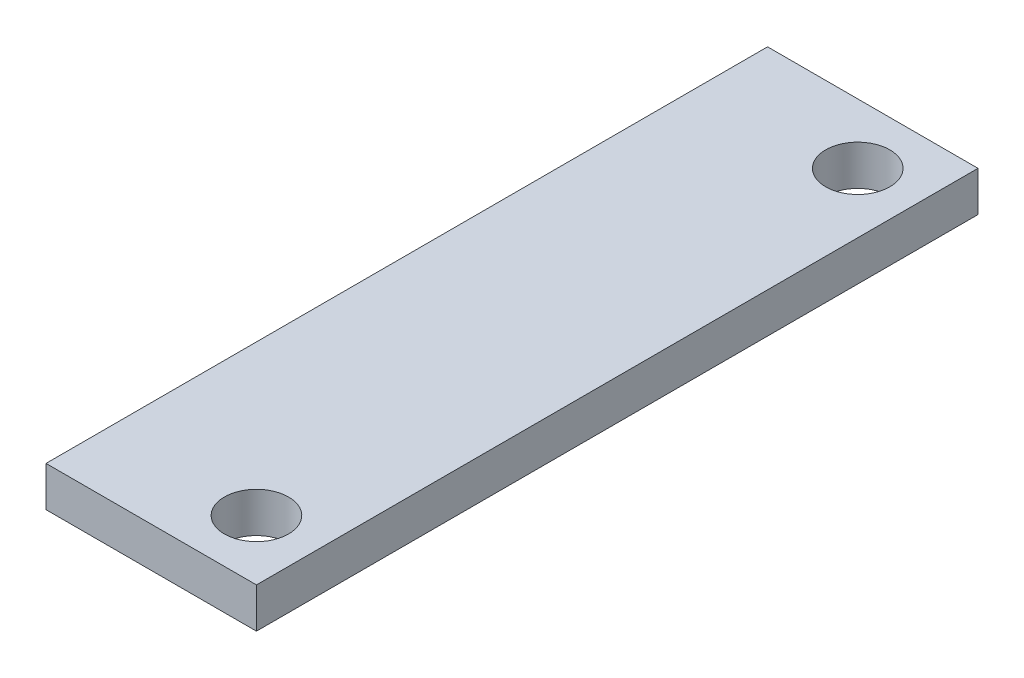
ISO-10303-21;
HEADER;
FILE_DESCRIPTION(('STEP AP214'),'2;1');
FILE_NAME('part.step','',(''),(''),'','','');
FILE_SCHEMA(('AUTOMOTIVE_DESIGN { 1 0 10303 214 1 1 1 1 }'));
ENDSEC;
DATA;
#1=APPLICATION_CONTEXT('core data for automotive mechanical design processes');
#2=APPLICATION_PROTOCOL_DEFINITION('international standard','automotive_design',2000,#1);
#3=PRODUCT_CONTEXT('',#1,'mechanical');
#4=PRODUCT('Part','Part','',(#3));
#5=PRODUCT_RELATED_PRODUCT_CATEGORY('part','',(#4));
#6=PRODUCT_DEFINITION_FORMATION('','',#4);
#7=PRODUCT_DEFINITION_CONTEXT('part definition',#1,'design');
#8=PRODUCT_DEFINITION('design','',#6,#7);
#9=PRODUCT_DEFINITION_SHAPE('','',#8);
#10=(LENGTH_UNIT() NAMED_UNIT(*) SI_UNIT(.MILLI.,.METRE.));
#11=(NAMED_UNIT(*) PLANE_ANGLE_UNIT() SI_UNIT($,.RADIAN.));
#12=(NAMED_UNIT(*) SI_UNIT($,.STERADIAN.) SOLID_ANGLE_UNIT());
#13=UNCERTAINTY_MEASURE_WITH_UNIT(LENGTH_MEASURE(1.E-05),#10,'distance_accuracy_value','');
#14=(GEOMETRIC_REPRESENTATION_CONTEXT(3) GLOBAL_UNCERTAINTY_ASSIGNED_CONTEXT((#13)) GLOBAL_UNIT_ASSIGNED_CONTEXT((#10,
#11,#12)) REPRESENTATION_CONTEXT('',''));
#15=CARTESIAN_POINT('',(0.,0.,0.));
#16=DIRECTION('',(0.,0.,1.));
#17=DIRECTION('',(1.,0.,0.));
#18=AXIS2_PLACEMENT_3D('',#15,#16,#17);
#19=CARTESIAN_POINT('',(0.,0.,0.));
#20=DIRECTION('',(0.,-1.,0.));
#21=DIRECTION('',(0.,0.,-1.));
#22=AXIS2_PLACEMENT_3D('',#19,#20,#21);
#23=PLANE('',#22);
#24=DIRECTION('',(0.,0.,-1.));
#25=VECTOR('',#24,1.);
#26=CARTESIAN_POINT('',(0.999999999999999,0.,-36.));
#27=LINE('',#26,#25);
#28=CARTESIAN_POINT('',(0.999999999999997,0.,-30.5));
#29=VERTEX_POINT('',#28);
#30=CARTESIAN_POINT('',(0.999999999999999,0.,-36.));
#31=VERTEX_POINT('',#30);
#32=EDGE_CURVE('E155',#29,#31,#27,.T.);
#33=ORIENTED_EDGE('',*,*,#32,.F.);
#34=DIRECTION('',(1.,0.,0.));
#35=VECTOR('',#34,1.);
#36=CARTESIAN_POINT('',(0.750000000000003,0.,-30.5));
#37=LINE('',#36,#35);
#38=CARTESIAN_POINT('',(0.750000000000003,0.,-30.5));
#39=VERTEX_POINT('',#38);
#40=EDGE_CURVE('E224',#39,#29,#37,.T.);
#41=ORIENTED_EDGE('',*,*,#40,.F.);
#42=DIRECTION('',(0.,0.,-1.));
#43=VECTOR('',#42,1.);
#44=CARTESIAN_POINT('',(0.750000000000003,0.,-30.5));
#45=LINE('',#44,#43);
#46=CARTESIAN_POINT('',(0.749999999999998,0.,-18.));
#47=VERTEX_POINT('',#46);
#48=EDGE_CURVE('E199',#47,#39,#45,.T.);
#49=ORIENTED_EDGE('',*,*,#48,.F.);
#50=DIRECTION('',(1.,0.,0.));
#51=VECTOR('',#50,1.);
#52=CARTESIAN_POINT('',(0.749999999999998,0.,-18.));
#53=LINE('',#52,#51);
#54=CARTESIAN_POINT('',(0.,0.,-18.));
#55=VERTEX_POINT('',#54);
#56=EDGE_CURVE('E187',#55,#47,#53,.T.);
#57=ORIENTED_EDGE('',*,*,#56,.F.);
#58=DIRECTION('',(0.,0.,1.));
#59=VECTOR('',#58,1.);
#60=CARTESIAN_POINT('',(0.,0.,0.));
#61=LINE('',#60,#59);
#62=CARTESIAN_POINT('',(0.,0.,-36.));
#63=VERTEX_POINT('',#62);
#64=EDGE_CURVE('E265',#63,#55,#61,.T.);
#65=ORIENTED_EDGE('',*,*,#64,.F.);
#66=DIRECTION('',(-1.,0.,0.));
#67=VECTOR('',#66,1.);
#68=CARTESIAN_POINT('',(0.,0.,-36.));
#69=LINE('',#68,#67);
#70=EDGE_CURVE('E272',#31,#63,#69,.T.);
#71=ORIENTED_EDGE('',*,*,#70,.F.);
#72=EDGE_LOOP('',(#33,#41,#49,#57,#65,#71));
#73=FACE_BOUND('',#72,.T.);
#74=ADVANCED_FACE('F36',(#73),#23,.T.);
#75=CARTESIAN_POINT('',(0.,2.,0.));
#76=DIRECTION('',(1.,0.,0.));
#77=DIRECTION('',(0.,0.,-1.));
#78=AXIS2_PLACEMENT_3D('',#75,#76,#77);
#79=PLANE('',#78);
#80=ORIENTED_EDGE('',*,*,#64,.T.);
#81=DIRECTION('',(0.,-1.,0.));
#82=VECTOR('',#81,1.);
#83=CARTESIAN_POINT('',(0.,0.5,-18.));
#84=LINE('',#83,#82);
#85=CARTESIAN_POINT('',(0.,0.5,-18.));
#86=VERTEX_POINT('',#85);
#87=EDGE_CURVE('E200',#86,#55,#84,.T.);
#88=ORIENTED_EDGE('',*,*,#87,.F.);
#89=DIRECTION('',(0.,0.,-1.));
#90=VECTOR('',#89,1.);
#91=CARTESIAN_POINT('',(0.,0.5,-18.));
#92=LINE('',#91,#90);
#93=CARTESIAN_POINT('',(0.,0.5,-17.));
#94=VERTEX_POINT('',#93);
#95=EDGE_CURVE('E190',#94,#86,#92,.T.);
#96=ORIENTED_EDGE('',*,*,#95,.F.);
#97=DIRECTION('',(0.,-1.,0.));
#98=VECTOR('',#97,1.);
#99=CARTESIAN_POINT('',(0.,0.5,-17.));
#100=LINE('',#99,#98);
#101=CARTESIAN_POINT('',(0.,0.,-17.));
#102=VERTEX_POINT('',#101);
#103=EDGE_CURVE('E202',#94,#102,#100,.T.);
#104=ORIENTED_EDGE('',*,*,#103,.T.);
#105=CARTESIAN_POINT('',(0.,0.,0.));
#106=VERTEX_POINT('',#105);
#107=EDGE_CURVE('E245',#102,#106,#61,.T.);
#108=ORIENTED_EDGE('',*,*,#107,.T.);
#109=DIRECTION('',(0.,-1.,0.));
#110=VECTOR('',#109,1.);
#111=CARTESIAN_POINT('',(0.,2.,0.));
#112=LINE('',#111,#110);
#113=CARTESIAN_POINT('',(0.,2.,0.));
#114=VERTEX_POINT('',#113);
#115=EDGE_CURVE('E11',#114,#106,#112,.T.);
#116=ORIENTED_EDGE('',*,*,#115,.F.);
#117=DIRECTION('',(0.,0.,1.));
#118=VECTOR('',#117,1.);
#119=CARTESIAN_POINT('',(0.,2.,0.));
#120=LINE('',#119,#118);
#121=CARTESIAN_POINT('',(0.,2.,-36.));
#122=VERTEX_POINT('',#121);
#123=EDGE_CURVE('E254',#122,#114,#120,.T.);
#124=ORIENTED_EDGE('',*,*,#123,.F.);
#125=DIRECTION('',(0.,-1.,0.));
#126=VECTOR('',#125,1.);
#127=CARTESIAN_POINT('',(0.,2.,-36.));
#128=LINE('',#127,#126);
#129=EDGE_CURVE('E264',#122,#63,#128,.T.);
#130=ORIENTED_EDGE('',*,*,#129,.T.);
#131=EDGE_LOOP('',(#80,#88,#96,#104,#108,#116,#124,#130));
#132=FACE_BOUND('',#131,.T.);
#133=ADVANCED_FACE('F38',(#132),#79,.F.);
#134=CARTESIAN_POINT('',(0.,2.,0.));
#135=DIRECTION('',(0.,0.,-1.));
#136=DIRECTION('',(-1.,0.,0.));
#137=AXIS2_PLACEMENT_3D('',#134,#135,#136);
#138=PLANE('',#137);
#139=DIRECTION('',(1.,0.,0.));
#140=VECTOR('',#139,1.);
#141=CARTESIAN_POINT('',(0.,0.,0.));
#142=LINE('',#141,#140);
#143=CARTESIAN_POINT('',(10.5,0.,0.));
#144=VERTEX_POINT('',#143);
#145=EDGE_CURVE('E268',#106,#144,#142,.T.);
#146=ORIENTED_EDGE('',*,*,#145,.T.);
#147=DIRECTION('',(0.,-1.,0.));
#148=VECTOR('',#147,1.);
#149=CARTESIAN_POINT('',(10.5,2.,0.));
#150=LINE('',#149,#148);
#151=CARTESIAN_POINT('',(10.5,2.,0.));
#152=VERTEX_POINT('',#151);
#153=EDGE_CURVE('E44',#152,#144,#150,.T.);
#154=ORIENTED_EDGE('',*,*,#153,.F.);
#155=DIRECTION('',(1.,0.,0.));
#156=VECTOR('',#155,1.);
#157=CARTESIAN_POINT('',(0.,2.,0.));
#158=LINE('',#157,#156);
#159=EDGE_CURVE('E257',#114,#152,#158,.T.);
#160=ORIENTED_EDGE('',*,*,#159,.F.);
#161=ORIENTED_EDGE('',*,*,#115,.T.);
#162=EDGE_LOOP('',(#146,#154,#160,#161));
#163=FACE_BOUND('',#162,.T.);
#164=ADVANCED_FACE('F300',(#163),#138,.F.);
#165=CARTESIAN_POINT('',(10.5,2.,0.));
#166=DIRECTION('',(-1.,0.,0.));
#167=DIRECTION('',(0.,0.,1.));
#168=AXIS2_PLACEMENT_3D('',#165,#166,#167);
#169=PLANE('',#168);
#170=DIRECTION('',(0.,0.,-1.));
#171=VECTOR('',#170,1.);
#172=CARTESIAN_POINT('',(10.5,0.,0.));
#173=LINE('',#172,#171);
#174=CARTESIAN_POINT('',(10.5,0.,-36.));
#175=VERTEX_POINT('',#174);
#176=EDGE_CURVE('E270',#144,#175,#173,.T.);
#177=ORIENTED_EDGE('',*,*,#176,.T.);
#178=DIRECTION('',(0.,-1.,0.));
#179=VECTOR('',#178,1.);
#180=CARTESIAN_POINT('',(10.5,2.,-36.));
#181=LINE('',#180,#179);
#182=CARTESIAN_POINT('',(10.5,2.,-36.));
#183=VERTEX_POINT('',#182);
#184=EDGE_CURVE('E276',#183,#175,#181,.T.);
#185=ORIENTED_EDGE('',*,*,#184,.F.);
#186=DIRECTION('',(0.,0.,-1.));
#187=VECTOR('',#186,1.);
#188=CARTESIAN_POINT('',(10.5,2.,0.));
#189=LINE('',#188,#187);
#190=EDGE_CURVE('E260',#152,#183,#189,.T.);
#191=ORIENTED_EDGE('',*,*,#190,.F.);
#192=ORIENTED_EDGE('',*,*,#153,.T.);
#193=EDGE_LOOP('',(#177,#185,#191,#192));
#194=FACE_BOUND('',#193,.T.);
#195=ADVANCED_FACE('F283',(#194),#169,.F.);
#196=CARTESIAN_POINT('',(0.,2.,-36.));
#197=DIRECTION('',(0.,0.,1.));
#198=DIRECTION('',(1.,0.,0.));
#199=AXIS2_PLACEMENT_3D('',#196,#197,#198);
#200=PLANE('',#199);
#201=DIRECTION('',(1.,0.,0.));
#202=VECTOR('',#201,1.);
#203=CARTESIAN_POINT('',(0.999999999999999,0.2,-36.));
#204=LINE('',#203,#202);
#205=CARTESIAN_POINT('',(0.999999999999999,0.2,-36.));
#206=VERTEX_POINT('',#205);
#207=CARTESIAN_POINT('',(5.3,0.2,-36.));
#208=VERTEX_POINT('',#207);
#209=EDGE_CURVE('E163',#206,#208,#204,.T.);
#210=ORIENTED_EDGE('',*,*,#209,.F.);
#211=DIRECTION('',(0.,-1.,0.));
#212=VECTOR('',#211,1.);
#213=CARTESIAN_POINT('',(0.999999999999999,0.2,-36.));
#214=LINE('',#213,#212);
#215=EDGE_CURVE('E150',#206,#31,#214,.T.);
#216=ORIENTED_EDGE('',*,*,#215,.T.);
#217=ORIENTED_EDGE('',*,*,#70,.T.);
#218=ORIENTED_EDGE('',*,*,#129,.F.);
#219=DIRECTION('',(-1.,0.,0.));
#220=VECTOR('',#219,1.);
#221=CARTESIAN_POINT('',(0.,2.,-36.));
#222=LINE('',#221,#220);
#223=EDGE_CURVE('E262',#183,#122,#222,.T.);
#224=ORIENTED_EDGE('',*,*,#223,.F.);
#225=ORIENTED_EDGE('',*,*,#184,.T.);
#226=CARTESIAN_POINT('',(5.3,0.,-36.));
#227=VERTEX_POINT('',#226);
#228=EDGE_CURVE('E258',#175,#227,#69,.T.);
#229=ORIENTED_EDGE('',*,*,#228,.T.);
#230=DIRECTION('',(0.,-1.,0.));
#231=VECTOR('',#230,1.);
#232=CARTESIAN_POINT('',(5.3,0.2,-36.));
#233=LINE('',#232,#231);
#234=EDGE_CURVE('E159',#208,#227,#233,.T.);
#235=ORIENTED_EDGE('',*,*,#234,.F.);
#236=EDGE_LOOP('',(#210,#216,#217,#218,#224,#225,#229,#235));
#237=FACE_BOUND('',#236,.T.);
#238=ADVANCED_FACE('F169',(#237),#200,.F.);
#239=CARTESIAN_POINT('',(0.,2.,0.));
#240=DIRECTION('',(0.,-1.,0.));
#241=DIRECTION('',(0.,0.,-1.));
#242=AXIS2_PLACEMENT_3D('',#239,#240,#241);
#243=PLANE('',#242);
#244=CARTESIAN_POINT('',(7.5,2.,-33.));
#245=DIRECTION('',(0.,-1.,0.));
#246=DIRECTION('',(0.,0.,-1.));
#247=AXIS2_PLACEMENT_3D('',#244,#245,#246);
#248=CIRCLE('',#247,1.6);
#249=CARTESIAN_POINT('',(7.5,2.,-34.6));
#250=VERTEX_POINT('',#249);
#251=EDGE_CURVE('E242',#250,#250,#248,.T.);
#252=ORIENTED_EDGE('',*,*,#251,.T.);
#253=EDGE_LOOP('',(#252));
#254=FACE_BOUND('',#253,.T.);
#255=CARTESIAN_POINT('',(7.5,2.,-3.));
#256=DIRECTION('',(0.,-1.,0.));
#257=DIRECTION('',(0.,0.,-1.));
#258=AXIS2_PLACEMENT_3D('',#255,#256,#257);
#259=CIRCLE('',#258,1.6);
#260=CARTESIAN_POINT('',(7.5,2.,-4.6));
#261=VERTEX_POINT('',#260);
#262=EDGE_CURVE('E249',#261,#261,#259,.T.);
#263=ORIENTED_EDGE('',*,*,#262,.T.);
#264=EDGE_LOOP('',(#263));
#265=FACE_BOUND('',#264,.T.);
#266=ORIENTED_EDGE('',*,*,#123,.T.);
#267=ORIENTED_EDGE('',*,*,#159,.T.);
#268=ORIENTED_EDGE('',*,*,#190,.T.);
#269=ORIENTED_EDGE('',*,*,#223,.T.);
#270=EDGE_LOOP('',(#266,#267,#268,#269));
#271=FACE_BOUND('',#270,.T.);
#272=ADVANCED_FACE('F298',(#254,#265,#271),#243,.F.);
#273=DIRECTION('',(0.,0.,1.));
#274=VECTOR('',#273,1.);
#275=CARTESIAN_POINT('',(5.3,0.,-36.));
#276=LINE('',#275,#274);
#277=CARTESIAN_POINT('',(5.3,0.,-30.5));
#278=VERTEX_POINT('',#277);
#279=EDGE_CURVE('E167',#227,#278,#276,.T.);
#280=ORIENTED_EDGE('',*,*,#279,.F.);
#281=ORIENTED_EDGE('',*,*,#228,.F.);
#282=ORIENTED_EDGE('',*,*,#176,.F.);
#283=ORIENTED_EDGE('',*,*,#145,.F.);
#284=ORIENTED_EDGE('',*,*,#107,.F.);
#285=DIRECTION('',(-1.,0.,0.));
#286=VECTOR('',#285,1.);
#287=CARTESIAN_POINT('',(0.749999999999998,0.,-17.));
#288=LINE('',#287,#286);
#289=CARTESIAN_POINT('',(0.749999999999998,0.,-17.));
#290=VERTEX_POINT('',#289);
#291=EDGE_CURVE('E179',#290,#102,#288,.T.);
#292=ORIENTED_EDGE('',*,*,#291,.F.);
#293=CARTESIAN_POINT('',(0.749999999999998,0.,-5.5));
#294=VERTEX_POINT('',#293);
#295=EDGE_CURVE('E220',#294,#290,#45,.T.);
#296=ORIENTED_EDGE('',*,*,#295,.F.);
#297=DIRECTION('',(-1.,0.,0.));
#298=VECTOR('',#297,1.);
#299=CARTESIAN_POINT('',(0.749999999999998,0.,-5.5));
#300=LINE('',#299,#298);
#301=CARTESIAN_POINT('',(9.75,0.,-5.5));
#302=VERTEX_POINT('',#301);
#303=EDGE_CURVE('E210',#302,#294,#300,.T.);
#304=ORIENTED_EDGE('',*,*,#303,.F.);
#305=DIRECTION('',(0.,0.,1.));
#306=VECTOR('',#305,1.);
#307=CARTESIAN_POINT('',(9.75,0.,-30.5));
#308=LINE('',#307,#306);
#309=CARTESIAN_POINT('',(9.75,0.,-30.5));
#310=VERTEX_POINT('',#309);
#311=EDGE_CURVE('E227',#310,#302,#308,.T.);
#312=ORIENTED_EDGE('',*,*,#311,.F.);
#313=EDGE_CURVE('E223',#278,#310,#37,.T.);
#314=ORIENTED_EDGE('',*,*,#313,.F.);
#315=EDGE_LOOP('',(#280,#281,#282,#283,#284,#292,#296,#304,#312,#314));
#316=FACE_BOUND('',#315,.T.);
#317=CARTESIAN_POINT('',(7.5,0.,-33.));
#318=DIRECTION('',(0.,-1.,0.));
#319=DIRECTION('',(0.,0.,-1.));
#320=AXIS2_PLACEMENT_3D('',#317,#318,#319);
#321=CIRCLE('',#320,1.6);
#322=CARTESIAN_POINT('',(7.5,0.,-34.6));
#323=VERTEX_POINT('',#322);
#324=EDGE_CURVE('E246',#323,#323,#321,.T.);
#325=ORIENTED_EDGE('',*,*,#324,.F.);
#326=EDGE_LOOP('',(#325));
#327=FACE_BOUND('',#326,.T.);
#328=CARTESIAN_POINT('',(7.5,0.,-3.));
#329=DIRECTION('',(0.,-1.,0.));
#330=DIRECTION('',(0.,0.,-1.));
#331=AXIS2_PLACEMENT_3D('',#328,#329,#330);
#332=CIRCLE('',#331,1.6);
#333=CARTESIAN_POINT('',(7.5,0.,-4.6));
#334=VERTEX_POINT('',#333);
#335=EDGE_CURVE('E234',#334,#334,#332,.T.);
#336=ORIENTED_EDGE('',*,*,#335,.F.);
#337=EDGE_LOOP('',(#336));
#338=FACE_BOUND('',#337,.T.);
#339=ADVANCED_FACE('F290',(#316,#327,#338),#23,.T.);
#340=CARTESIAN_POINT('',(7.5,2.,-3.));
#341=DIRECTION('',(0.,-1.,0.));
#342=DIRECTION('',(0.,0.,-1.));
#343=AXIS2_PLACEMENT_3D('',#340,#341,#342);
#344=CYLINDRICAL_SURFACE('',#343,1.6);
#345=ORIENTED_EDGE('',*,*,#262,.F.);
#346=EDGE_LOOP('',(#345));
#347=FACE_BOUND('',#346,.T.);
#348=ORIENTED_EDGE('',*,*,#335,.T.);
#349=EDGE_LOOP('',(#348));
#350=FACE_BOUND('',#349,.T.);
#351=ADVANCED_FACE('F342',(#347,#350),#344,.F.);
#352=CARTESIAN_POINT('',(7.5,2.,-33.));
#353=DIRECTION('',(0.,-1.,0.));
#354=DIRECTION('',(0.,0.,-1.));
#355=AXIS2_PLACEMENT_3D('',#352,#353,#354);
#356=CYLINDRICAL_SURFACE('',#355,1.6);
#357=ORIENTED_EDGE('',*,*,#251,.F.);
#358=EDGE_LOOP('',(#357));
#359=FACE_BOUND('',#358,.T.);
#360=ORIENTED_EDGE('',*,*,#324,.T.);
#361=EDGE_LOOP('',(#360));
#362=FACE_BOUND('',#361,.T.);
#363=ADVANCED_FACE('F347',(#359,#362),#356,.F.);
#364=CARTESIAN_POINT('',(0.750000000000003,1.,-30.5));
#365=DIRECTION('',(-1.,0.,0.));
#366=DIRECTION('',(0.,0.,1.));
#367=AXIS2_PLACEMENT_3D('',#364,#365,#366);
#368=PLANE('',#367);
#369=DIRECTION('',(0.,0.,1.));
#370=VECTOR('',#369,1.);
#371=CARTESIAN_POINT('',(0.749999999999998,0.5,-18.));
#372=LINE('',#371,#370);
#373=CARTESIAN_POINT('',(0.750000000000001,0.5,-18.));
#374=VERTEX_POINT('',#373);
#375=CARTESIAN_POINT('',(0.749999999999998,0.5,-17.));
#376=VERTEX_POINT('',#375);
#377=EDGE_CURVE('E184',#374,#376,#372,.T.);
#378=ORIENTED_EDGE('',*,*,#377,.F.);
#379=DIRECTION('',(0.,-1.,0.));
#380=VECTOR('',#379,1.);
#381=CARTESIAN_POINT('',(0.749999999999998,0.5,-18.));
#382=LINE('',#381,#380);
#383=EDGE_CURVE('E196',#374,#47,#382,.T.);
#384=ORIENTED_EDGE('',*,*,#383,.T.);
#385=ORIENTED_EDGE('',*,*,#48,.T.);
#386=DIRECTION('',(0.,-1.,0.));
#387=VECTOR('',#386,1.);
#388=CARTESIAN_POINT('',(0.750000000000003,1.,-30.5));
#389=LINE('',#388,#387);
#390=CARTESIAN_POINT('',(0.750000000000003,1.,-30.5));
#391=VERTEX_POINT('',#390);
#392=EDGE_CURVE('E219',#391,#39,#389,.T.);
#393=ORIENTED_EDGE('',*,*,#392,.F.);
#394=DIRECTION('',(0.,0.,-1.));
#395=VECTOR('',#394,1.);
#396=CARTESIAN_POINT('',(0.750000000000003,1.,-30.5));
#397=LINE('',#396,#395);
#398=CARTESIAN_POINT('',(0.749999999999998,1.,-5.5));
#399=VERTEX_POINT('',#398);
#400=EDGE_CURVE('E206',#399,#391,#397,.T.);
#401=ORIENTED_EDGE('',*,*,#400,.F.);
#402=DIRECTION('',(0.,-1.,0.));
#403=VECTOR('',#402,1.);
#404=CARTESIAN_POINT('',(0.749999999999998,1.,-5.5));
#405=LINE('',#404,#403);
#406=EDGE_CURVE('E232',#399,#294,#405,.T.);
#407=ORIENTED_EDGE('',*,*,#406,.T.);
#408=ORIENTED_EDGE('',*,*,#295,.T.);
#409=DIRECTION('',(0.,-1.,0.));
#410=VECTOR('',#409,1.);
#411=CARTESIAN_POINT('',(0.749999999999998,0.5,-17.));
#412=LINE('',#411,#410);
#413=EDGE_CURVE('E193',#376,#290,#412,.T.);
#414=ORIENTED_EDGE('',*,*,#413,.F.);
#415=EDGE_LOOP('',(#378,#384,#385,#393,#401,#407,#408,#414));
#416=FACE_BOUND('',#415,.T.);
#417=ADVANCED_FACE('F310',(#416),#368,.F.);
#418=CARTESIAN_POINT('',(0.749999999999998,1.,-5.5));
#419=DIRECTION('',(0.,0.,1.));
#420=DIRECTION('',(1.,0.,0.));
#421=AXIS2_PLACEMENT_3D('',#418,#419,#420);
#422=PLANE('',#421);
#423=ORIENTED_EDGE('',*,*,#303,.T.);
#424=ORIENTED_EDGE('',*,*,#406,.F.);
#425=DIRECTION('',(-1.,0.,0.));
#426=VECTOR('',#425,1.);
#427=CARTESIAN_POINT('',(0.749999999999998,1.,-5.5));
#428=LINE('',#427,#426);
#429=CARTESIAN_POINT('',(9.75,1.,-5.5));
#430=VERTEX_POINT('',#429);
#431=EDGE_CURVE('E216',#430,#399,#428,.T.);
#432=ORIENTED_EDGE('',*,*,#431,.F.);
#433=DIRECTION('',(0.,-1.,0.));
#434=VECTOR('',#433,1.);
#435=CARTESIAN_POINT('',(9.75,1.,-5.5));
#436=LINE('',#435,#434);
#437=EDGE_CURVE('E235',#430,#302,#436,.T.);
#438=ORIENTED_EDGE('',*,*,#437,.T.);
#439=EDGE_LOOP('',(#423,#424,#432,#438));
#440=FACE_BOUND('',#439,.T.);
#441=ADVANCED_FACE('F314',(#440),#422,.F.);
#442=CARTESIAN_POINT('',(9.75,1.,-30.5));
#443=DIRECTION('',(1.,0.,0.));
#444=DIRECTION('',(0.,0.,-1.));
#445=AXIS2_PLACEMENT_3D('',#442,#443,#444);
#446=PLANE('',#445);
#447=ORIENTED_EDGE('',*,*,#311,.T.);
#448=ORIENTED_EDGE('',*,*,#437,.F.);
#449=DIRECTION('',(0.,0.,1.));
#450=VECTOR('',#449,1.);
#451=CARTESIAN_POINT('',(9.75,1.,-30.5));
#452=LINE('',#451,#450);
#453=CARTESIAN_POINT('',(9.75,1.,-30.5));
#454=VERTEX_POINT('',#453);
#455=EDGE_CURVE('E213',#454,#430,#452,.T.);
#456=ORIENTED_EDGE('',*,*,#455,.F.);
#457=DIRECTION('',(0.,-1.,0.));
#458=VECTOR('',#457,1.);
#459=CARTESIAN_POINT('',(9.75,1.,-30.5));
#460=LINE('',#459,#458);
#461=EDGE_CURVE('E237',#454,#310,#460,.T.);
#462=ORIENTED_EDGE('',*,*,#461,.T.);
#463=EDGE_LOOP('',(#447,#448,#456,#462));
#464=FACE_BOUND('',#463,.T.);
#465=ADVANCED_FACE('F317',(#464),#446,.F.);
#466=CARTESIAN_POINT('',(0.750000000000003,1.,-30.5));
#467=DIRECTION('',(0.,0.,-1.));
#468=DIRECTION('',(-1.,0.,0.));
#469=AXIS2_PLACEMENT_3D('',#466,#467,#468);
#470=PLANE('',#469);
#471=ORIENTED_EDGE('',*,*,#40,.T.);
#472=DIRECTION('',(0.,-1.,0.));
#473=VECTOR('',#472,1.);
#474=CARTESIAN_POINT('',(0.999999999999997,0.2,-30.5));
#475=LINE('',#474,#473);
#476=CARTESIAN_POINT('',(0.999999999999997,0.2,-30.5));
#477=VERTEX_POINT('',#476);
#478=EDGE_CURVE('E177',#477,#29,#475,.T.);
#479=ORIENTED_EDGE('',*,*,#478,.F.);
#480=DIRECTION('',(-1.,0.,0.));
#481=VECTOR('',#480,1.);
#482=CARTESIAN_POINT('',(0.999999999999997,0.2,-30.5));
#483=LINE('',#482,#481);
#484=CARTESIAN_POINT('',(5.3,0.2,-30.5));
#485=VERTEX_POINT('',#484);
#486=EDGE_CURVE('E160',#485,#477,#483,.T.);
#487=ORIENTED_EDGE('',*,*,#486,.F.);
#488=DIRECTION('',(0.,-1.,0.));
#489=VECTOR('',#488,1.);
#490=CARTESIAN_POINT('',(5.3,0.2,-30.5));
#491=LINE('',#490,#489);
#492=EDGE_CURVE('E180',#485,#278,#491,.T.);
#493=ORIENTED_EDGE('',*,*,#492,.T.);
#494=ORIENTED_EDGE('',*,*,#313,.T.);
#495=ORIENTED_EDGE('',*,*,#461,.F.);
#496=DIRECTION('',(1.,0.,0.));
#497=VECTOR('',#496,1.);
#498=CARTESIAN_POINT('',(0.750000000000003,1.,-30.5));
#499=LINE('',#498,#497);
#500=EDGE_CURVE('E209',#391,#454,#499,.T.);
#501=ORIENTED_EDGE('',*,*,#500,.F.);
#502=ORIENTED_EDGE('',*,*,#392,.T.);
#503=EDGE_LOOP('',(#471,#479,#487,#493,#494,#495,#501,#502));
#504=FACE_BOUND('',#503,.T.);
#505=ADVANCED_FACE('F321',(#504),#470,.F.);
#506=CARTESIAN_POINT('',(0.,1.,0.));
#507=DIRECTION('',(0.,1.,0.));
#508=DIRECTION('',(0.,0.,1.));
#509=AXIS2_PLACEMENT_3D('',#506,#507,#508);
#510=PLANE('',#509);
#511=ORIENTED_EDGE('',*,*,#400,.T.);
#512=ORIENTED_EDGE('',*,*,#500,.T.);
#513=ORIENTED_EDGE('',*,*,#455,.T.);
#514=ORIENTED_EDGE('',*,*,#431,.T.);
#515=EDGE_LOOP('',(#511,#512,#513,#514));
#516=FACE_BOUND('',#515,.T.);
#517=ADVANCED_FACE('F363',(#516),#510,.F.);
#518=CARTESIAN_POINT('',(0.749999999999998,0.5,-18.));
#519=DIRECTION('',(0.,0.,-1.));
#520=DIRECTION('',(-1.,0.,0.));
#521=AXIS2_PLACEMENT_3D('',#518,#519,#520);
#522=PLANE('',#521);
#523=ORIENTED_EDGE('',*,*,#56,.T.);
#524=ORIENTED_EDGE('',*,*,#383,.F.);
#525=DIRECTION('',(1.,0.,0.));
#526=VECTOR('',#525,1.);
#527=CARTESIAN_POINT('',(0.749999999999998,0.5,-18.));
#528=LINE('',#527,#526);
#529=EDGE_CURVE('E59',#86,#374,#528,.T.);
#530=ORIENTED_EDGE('',*,*,#529,.F.);
#531=ORIENTED_EDGE('',*,*,#87,.T.);
#532=EDGE_LOOP('',(#523,#524,#530,#531));
#533=FACE_BOUND('',#532,.T.);
#534=ADVANCED_FACE('F370',(#533),#522,.F.);
#535=CARTESIAN_POINT('',(0.749999999999998,0.5,-17.));
#536=DIRECTION('',(0.,0.,1.));
#537=DIRECTION('',(1.,0.,0.));
#538=AXIS2_PLACEMENT_3D('',#535,#536,#537);
#539=PLANE('',#538);
#540=ORIENTED_EDGE('',*,*,#291,.T.);
#541=ORIENTED_EDGE('',*,*,#103,.F.);
#542=DIRECTION('',(-1.,0.,0.));
#543=VECTOR('',#542,1.);
#544=CARTESIAN_POINT('',(0.749999999999998,0.5,-17.));
#545=LINE('',#544,#543);
#546=EDGE_CURVE('E186',#376,#94,#545,.T.);
#547=ORIENTED_EDGE('',*,*,#546,.F.);
#548=ORIENTED_EDGE('',*,*,#413,.T.);
#549=EDGE_LOOP('',(#540,#541,#547,#548));
#550=FACE_BOUND('',#549,.T.);
#551=ADVANCED_FACE('F372',(#550),#539,.F.);
#552=CARTESIAN_POINT('',(0.,0.5,0.));
#553=DIRECTION('',(0.,-1.,0.));
#554=DIRECTION('',(0.,0.,-1.));
#555=AXIS2_PLACEMENT_3D('',#552,#553,#554);
#556=PLANE('',#555);
#557=ORIENTED_EDGE('',*,*,#377,.T.);
#558=ORIENTED_EDGE('',*,*,#546,.T.);
#559=ORIENTED_EDGE('',*,*,#95,.T.);
#560=ORIENTED_EDGE('',*,*,#529,.T.);
#561=EDGE_LOOP('',(#557,#558,#559,#560));
#562=FACE_BOUND('',#561,.T.);
#563=ADVANCED_FACE('F331',(#562),#556,.T.);
#564=CARTESIAN_POINT('',(0.999999999999999,0.2,-36.));
#565=DIRECTION('',(-1.,0.,0.));
#566=DIRECTION('',(0.,0.,1.));
#567=AXIS2_PLACEMENT_3D('',#564,#565,#566);
#568=PLANE('',#567);
#569=ORIENTED_EDGE('',*,*,#32,.T.);
#570=ORIENTED_EDGE('',*,*,#215,.F.);
#571=DIRECTION('',(0.,0.,-1.));
#572=VECTOR('',#571,1.);
#573=CARTESIAN_POINT('',(0.999999999999999,0.2,-36.));
#574=LINE('',#573,#572);
#575=EDGE_CURVE('E153',#477,#206,#574,.T.);
#576=ORIENTED_EDGE('',*,*,#575,.F.);
#577=ORIENTED_EDGE('',*,*,#478,.T.);
#578=EDGE_LOOP('',(#569,#570,#576,#577));
#579=FACE_BOUND('',#578,.T.);
#580=ADVANCED_FACE('F152',(#579),#568,.F.);
#581=CARTESIAN_POINT('',(5.3,0.2,-36.));
#582=DIRECTION('',(1.,0.,0.));
#583=DIRECTION('',(0.,0.,-1.));
#584=AXIS2_PLACEMENT_3D('',#581,#582,#583);
#585=PLANE('',#584);
#586=ORIENTED_EDGE('',*,*,#279,.T.);
#587=ORIENTED_EDGE('',*,*,#492,.F.);
#588=DIRECTION('',(0.,0.,1.));
#589=VECTOR('',#588,1.);
#590=CARTESIAN_POINT('',(5.3,0.2,-36.));
#591=LINE('',#590,#589);
#592=EDGE_CURVE('E51',#208,#485,#591,.T.);
#593=ORIENTED_EDGE('',*,*,#592,.F.);
#594=ORIENTED_EDGE('',*,*,#234,.T.);
#595=EDGE_LOOP('',(#586,#587,#593,#594));
#596=FACE_BOUND('',#595,.T.);
#597=ADVANCED_FACE('F323',(#596),#585,.F.);
#598=CARTESIAN_POINT('',(0.,0.2,0.));
#599=DIRECTION('',(0.,1.,0.));
#600=DIRECTION('',(0.,0.,1.));
#601=AXIS2_PLACEMENT_3D('',#598,#599,#600);
#602=PLANE('',#601);
#603=ORIENTED_EDGE('',*,*,#575,.T.);
#604=ORIENTED_EDGE('',*,*,#209,.T.);
#605=ORIENTED_EDGE('',*,*,#592,.T.);
#606=ORIENTED_EDGE('',*,*,#486,.T.);
#607=EDGE_LOOP('',(#603,#604,#605,#606));
#608=FACE_BOUND('',#607,.T.);
#609=ADVANCED_FACE('F162',(#608),#602,.F.);
#610=CLOSED_SHELL('',(#74,#133,#164,#195,#238,#272,#339,#351,#363,#417,#441,#465,#505,#517,#534,
#551,#563,#580,#597,#609));
#611=MANIFOLD_SOLID_BREP('B2',#610);
#612=ADVANCED_BREP_SHAPE_REPRESENTATION('',(#18,#611),#14);
#613=SHAPE_DEFINITION_REPRESENTATION(#9,#612);
ENDSEC;
END-ISO-10303-21;
